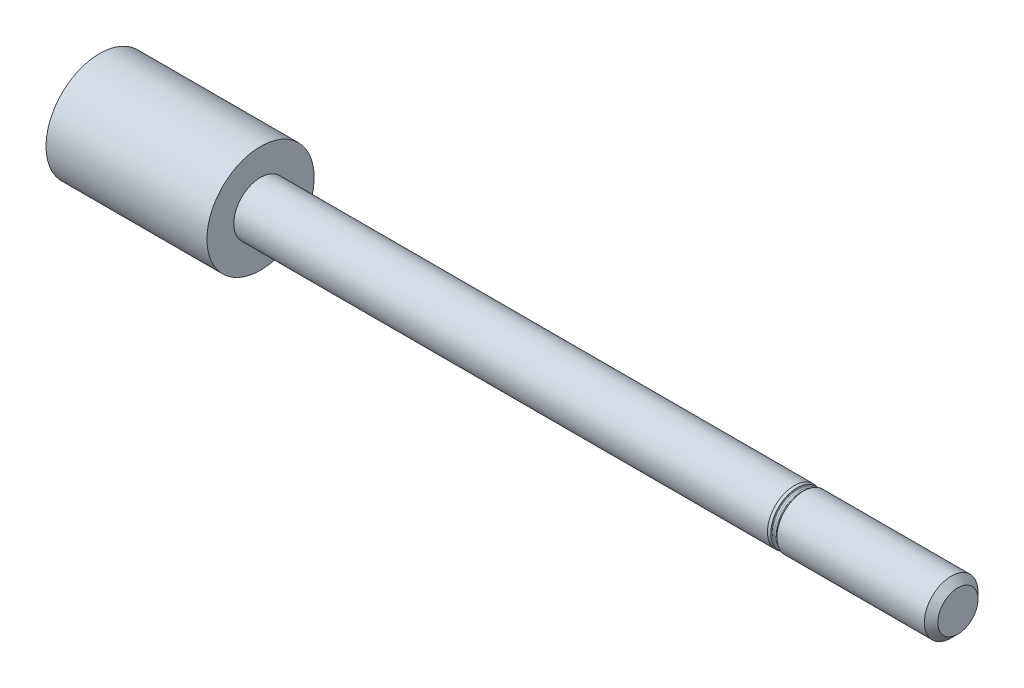
ISO-10303-21;
HEADER;
FILE_DESCRIPTION(('STEP AP214'),'2;1');
FILE_NAME('part.step','',(''),(''),'','','');
FILE_SCHEMA(('AUTOMOTIVE_DESIGN { 1 0 10303 214 1 1 1 1 }'));
ENDSEC;
DATA;
#1=APPLICATION_CONTEXT('core data for automotive mechanical design processes');
#2=APPLICATION_PROTOCOL_DEFINITION('international standard','automotive_design',2000,#1);
#3=PRODUCT_CONTEXT('',#1,'mechanical');
#4=PRODUCT('Part','Part','',(#3));
#5=PRODUCT_RELATED_PRODUCT_CATEGORY('part','',(#4));
#6=PRODUCT_DEFINITION_FORMATION('','',#4);
#7=PRODUCT_DEFINITION_CONTEXT('part definition',#1,'design');
#8=PRODUCT_DEFINITION('design','',#6,#7);
#9=PRODUCT_DEFINITION_SHAPE('','',#8);
#10=(LENGTH_UNIT() NAMED_UNIT(*) SI_UNIT(.MILLI.,.METRE.));
#11=(NAMED_UNIT(*) PLANE_ANGLE_UNIT() SI_UNIT($,.RADIAN.));
#12=(NAMED_UNIT(*) SI_UNIT($,.STERADIAN.) SOLID_ANGLE_UNIT());
#13=UNCERTAINTY_MEASURE_WITH_UNIT(LENGTH_MEASURE(1.E-05),#10,'distance_accuracy_value','');
#14=(GEOMETRIC_REPRESENTATION_CONTEXT(3) GLOBAL_UNCERTAINTY_ASSIGNED_CONTEXT((#13)) GLOBAL_UNIT_ASSIGNED_CONTEXT((#10,
#11,#12)) REPRESENTATION_CONTEXT('',''));
#15=CARTESIAN_POINT('',(0.,0.,0.));
#16=DIRECTION('',(0.,0.,1.));
#17=DIRECTION('',(1.,0.,0.));
#18=AXIS2_PLACEMENT_3D('',#15,#16,#17);
#19=CARTESIAN_POINT('',(27.,1.5,0.));
#20=DIRECTION('',(1.,0.,0.));
#21=DIRECTION('',(0.,0.,-1.));
#22=AXIS2_PLACEMENT_3D('',#19,#20,#21);
#23=PLANE('',#22);
#24=CARTESIAN_POINT('',(27.,0.,0.));
#25=DIRECTION('',(-1.,0.,0.));
#26=DIRECTION('',(0.,0.,1.));
#27=AXIS2_PLACEMENT_3D('',#24,#25,#26);
#28=CIRCLE('',#27,1.5);
#29=CARTESIAN_POINT('',(27.,0.,1.5));
#30=VERTEX_POINT('',#29);
#31=EDGE_CURVE('E10',#30,#30,#28,.T.);
#32=ORIENTED_EDGE('',*,*,#31,.F.);
#33=EDGE_LOOP('',(#32));
#34=FACE_BOUND('',#33,.T.);
#35=ADVANCED_FACE('F35',(#34),#23,.T.);
#36=CARTESIAN_POINT('',(26.5,0.,0.));
#37=DIRECTION('',(-1.,0.,0.));
#38=DIRECTION('',(0.,0.,1.));
#39=AXIS2_PLACEMENT_3D('',#36,#37,#38);
#40=CONICAL_SURFACE('',#39,2.,0.785398163397453);
#41=ORIENTED_EDGE('',*,*,#31,.T.);
#42=EDGE_LOOP('',(#41));
#43=FACE_BOUND('',#42,.T.);
#44=CARTESIAN_POINT('',(26.5,0.,0.));
#45=DIRECTION('',(-1.,0.,0.));
#46=DIRECTION('',(0.,0.,1.));
#47=AXIS2_PLACEMENT_3D('',#44,#45,#46);
#48=CIRCLE('',#47,2.);
#49=CARTESIAN_POINT('',(26.5,0.,2.));
#50=VERTEX_POINT('',#49);
#51=EDGE_CURVE('E41',#50,#50,#48,.T.);
#52=ORIENTED_EDGE('',*,*,#51,.F.);
#53=EDGE_LOOP('',(#52));
#54=FACE_BOUND('',#53,.T.);
#55=ADVANCED_FACE('F95',(#43,#54),#40,.T.);
#56=CARTESIAN_POINT('',(0.,0.,0.));
#57=DIRECTION('',(-1.,0.,0.));
#58=DIRECTION('',(0.,0.,1.));
#59=AXIS2_PLACEMENT_3D('',#56,#57,#58);
#60=CYLINDRICAL_SURFACE('',#59,2.);
#61=ORIENTED_EDGE('',*,*,#51,.T.);
#62=EDGE_LOOP('',(#61));
#63=FACE_BOUND('',#62,.T.);
#64=CARTESIAN_POINT('',(15.5,0.,0.));
#65=DIRECTION('',(-1.,0.,0.));
#66=DIRECTION('',(0.,0.,1.));
#67=AXIS2_PLACEMENT_3D('',#64,#65,#66);
#68=CIRCLE('',#67,2.);
#69=CARTESIAN_POINT('',(15.5,0.,2.));
#70=VERTEX_POINT('',#69);
#71=EDGE_CURVE('E45',#70,#70,#68,.T.);
#72=ORIENTED_EDGE('',*,*,#71,.F.);
#73=EDGE_LOOP('',(#72));
#74=FACE_BOUND('',#73,.T.);
#75=ADVANCED_FACE('F100',(#63,#74),#60,.T.);
#76=CARTESIAN_POINT('',(15.2792893218813,0.,0.));
#77=DIRECTION('',(1.,0.,0.));
#78=DIRECTION('',(0.,0.,-1.));
#79=AXIS2_PLACEMENT_3D('',#76,#77,#78);
#80=CONICAL_SURFACE('',#79,1.77928932188135,0.785398163397447);
#81=ORIENTED_EDGE('',*,*,#71,.T.);
#82=EDGE_LOOP('',(#81));
#83=FACE_BOUND('',#82,.T.);
#84=CARTESIAN_POINT('',(15.2792893218813,0.,0.));
#85=DIRECTION('',(-1.,0.,0.));
#86=DIRECTION('',(0.,0.,1.));
#87=AXIS2_PLACEMENT_3D('',#84,#85,#86);
#88=CIRCLE('',#87,1.77928932188135);
#89=CARTESIAN_POINT('',(15.2792893218813,0.,1.77928932188135));
#90=VERTEX_POINT('',#89);
#91=EDGE_CURVE('E49',#90,#90,#88,.T.);
#92=ORIENTED_EDGE('',*,*,#91,.F.);
#93=EDGE_LOOP('',(#92));
#94=FACE_BOUND('',#93,.T.);
#95=ADVANCED_FACE('F104',(#83,#94),#80,.T.);
#96=CARTESIAN_POINT('',(15.2085786437627,0.,0.));
#97=DIRECTION('',(-1.,0.,0.));
#98=DIRECTION('',(0.,0.,1.));
#99=AXIS2_PLACEMENT_3D('',#96,#97,#98);
#100=TOROIDAL_SURFACE('',#99,1.85,0.1);
#101=ORIENTED_EDGE('',*,*,#91,.T.);
#102=EDGE_LOOP('',(#101));
#103=FACE_BOUND('',#102,.T.);
#104=CARTESIAN_POINT('',(15.2085786437627,0.,0.));
#105=DIRECTION('',(-1.,0.,0.));
#106=DIRECTION('',(0.,0.,1.));
#107=AXIS2_PLACEMENT_3D('',#104,#105,#106);
#108=CIRCLE('',#107,1.75);
#109=CARTESIAN_POINT('',(15.2085786437627,0.,1.75));
#110=VERTEX_POINT('',#109);
#111=EDGE_CURVE('E54',#110,#110,#108,.T.);
#112=ORIENTED_EDGE('',*,*,#111,.F.);
#113=EDGE_LOOP('',(#112));
#114=FACE_BOUND('',#113,.T.);
#115=ADVANCED_FACE('F110',(#103,#114),#100,.F.);
#116=CARTESIAN_POINT('',(0.,0.,0.));
#117=DIRECTION('',(-1.,0.,0.));
#118=DIRECTION('',(0.,0.,1.));
#119=AXIS2_PLACEMENT_3D('',#116,#117,#118);
#120=CYLINDRICAL_SURFACE('',#119,1.75);
#121=ORIENTED_EDGE('',*,*,#111,.T.);
#122=EDGE_LOOP('',(#121));
#123=FACE_BOUND('',#122,.T.);
#124=CARTESIAN_POINT('',(15.1,0.,0.));
#125=DIRECTION('',(-1.,0.,0.));
#126=DIRECTION('',(0.,0.,1.));
#127=AXIS2_PLACEMENT_3D('',#124,#125,#126);
#128=CIRCLE('',#127,1.75);
#129=CARTESIAN_POINT('',(15.1,0.,1.75));
#130=VERTEX_POINT('',#129);
#131=EDGE_CURVE('E57',#130,#130,#128,.T.);
#132=ORIENTED_EDGE('',*,*,#131,.F.);
#133=EDGE_LOOP('',(#132));
#134=FACE_BOUND('',#133,.T.);
#135=ADVANCED_FACE('F114',(#123,#134),#120,.T.);
#136=CARTESIAN_POINT('',(15.1,0.,0.));
#137=DIRECTION('',(-1.,0.,0.));
#138=DIRECTION('',(0.,0.,1.));
#139=AXIS2_PLACEMENT_3D('',#136,#137,#138);
#140=TOROIDAL_SURFACE('',#139,1.85,0.1);
#141=ORIENTED_EDGE('',*,*,#131,.T.);
#142=EDGE_LOOP('',(#141));
#143=FACE_BOUND('',#142,.T.);
#144=CARTESIAN_POINT('',(15.,0.,0.));
#145=DIRECTION('',(-1.,0.,0.));
#146=DIRECTION('',(0.,0.,1.));
#147=AXIS2_PLACEMENT_3D('',#144,#145,#146);
#148=CIRCLE('',#147,1.85);
#149=CARTESIAN_POINT('',(15.,0.,1.85));
#150=VERTEX_POINT('',#149);
#151=EDGE_CURVE('E60',#150,#150,#148,.T.);
#152=ORIENTED_EDGE('',*,*,#151,.F.);
#153=EDGE_LOOP('',(#152));
#154=FACE_BOUND('',#153,.T.);
#155=ADVANCED_FACE('F118',(#143,#154),#140,.F.);
#156=CARTESIAN_POINT('',(15.,1.94641016151378,0.));
#157=DIRECTION('',(1.,0.,0.));
#158=DIRECTION('',(0.,0.,-1.));
#159=AXIS2_PLACEMENT_3D('',#156,#157,#158);
#160=PLANE('',#159);
#161=ORIENTED_EDGE('',*,*,#151,.T.);
#162=EDGE_LOOP('',(#161));
#163=FACE_BOUND('',#162,.T.);
#164=CARTESIAN_POINT('',(15.,0.,0.));
#165=DIRECTION('',(-1.,0.,0.));
#166=DIRECTION('',(0.,0.,1.));
#167=AXIS2_PLACEMENT_3D('',#164,#165,#166);
#168=CIRCLE('',#167,1.94641016151378);
#169=CARTESIAN_POINT('',(15.,0.,1.94641016151378));
#170=VERTEX_POINT('',#169);
#171=EDGE_CURVE('E63',#170,#170,#168,.T.);
#172=ORIENTED_EDGE('',*,*,#171,.F.);
#173=EDGE_LOOP('',(#172));
#174=FACE_BOUND('',#173,.T.);
#175=ADVANCED_FACE('F122',(#163,#174),#160,.T.);
#176=CARTESIAN_POINT('',(14.8,0.,0.));
#177=DIRECTION('',(-1.,0.,0.));
#178=DIRECTION('',(0.,0.,1.));
#179=AXIS2_PLACEMENT_3D('',#176,#177,#178);
#180=CONICAL_SURFACE('',#179,2.,0.26179938779915);
#181=ORIENTED_EDGE('',*,*,#171,.T.);
#182=EDGE_LOOP('',(#181));
#183=FACE_BOUND('',#182,.T.);
#184=CARTESIAN_POINT('',(14.8,0.,0.));
#185=DIRECTION('',(-1.,0.,0.));
#186=DIRECTION('',(0.,0.,1.));
#187=AXIS2_PLACEMENT_3D('',#184,#185,#186);
#188=CIRCLE('',#187,2.);
#189=CARTESIAN_POINT('',(14.8,0.,2.));
#190=VERTEX_POINT('',#189);
#191=EDGE_CURVE('E66',#190,#190,#188,.T.);
#192=ORIENTED_EDGE('',*,*,#191,.F.);
#193=EDGE_LOOP('',(#192));
#194=FACE_BOUND('',#193,.T.);
#195=ADVANCED_FACE('F126',(#183,#194),#180,.T.);
#196=CARTESIAN_POINT('',(0.,0.,0.));
#197=DIRECTION('',(-1.,0.,0.));
#198=DIRECTION('',(0.,0.,1.));
#199=AXIS2_PLACEMENT_3D('',#196,#197,#198);
#200=CYLINDRICAL_SURFACE('',#199,2.);
#201=ORIENTED_EDGE('',*,*,#191,.T.);
#202=EDGE_LOOP('',(#201));
#203=FACE_BOUND('',#202,.T.);
#204=CARTESIAN_POINT('',(-25.,0.,0.));
#205=DIRECTION('',(-1.,0.,0.));
#206=DIRECTION('',(0.,0.,1.));
#207=AXIS2_PLACEMENT_3D('',#204,#205,#206);
#208=CIRCLE('',#207,2.);
#209=CARTESIAN_POINT('',(-25.,0.,2.));
#210=VERTEX_POINT('',#209);
#211=EDGE_CURVE('E69',#210,#210,#208,.T.);
#212=ORIENTED_EDGE('',*,*,#211,.F.);
#213=EDGE_LOOP('',(#212));
#214=FACE_BOUND('',#213,.T.);
#215=ADVANCED_FACE('F91',(#203,#214),#200,.T.);
#216=CARTESIAN_POINT('',(-25.,2.,0.));
#217=DIRECTION('',(-1.,0.,0.));
#218=DIRECTION('',(0.,0.,1.));
#219=AXIS2_PLACEMENT_3D('',#216,#217,#218);
#220=PLANE('',#219);
#221=CARTESIAN_POINT('',(-25.,0.,0.));
#222=DIRECTION('',(-1.,0.,0.));
#223=DIRECTION('',(0.,0.,1.));
#224=AXIS2_PLACEMENT_3D('',#221,#222,#223);
#225=CIRCLE('',#224,4.);
#226=CARTESIAN_POINT('',(-25.,0.,4.));
#227=VERTEX_POINT('',#226);
#228=EDGE_CURVE('E72',#227,#227,#225,.T.);
#229=ORIENTED_EDGE('',*,*,#228,.F.);
#230=EDGE_LOOP('',(#229));
#231=FACE_BOUND('',#230,.T.);
#232=ORIENTED_EDGE('',*,*,#211,.T.);
#233=EDGE_LOOP('',(#232));
#234=FACE_BOUND('',#233,.T.);
#235=ADVANCED_FACE('F83',(#231,#234),#220,.F.);
#236=CARTESIAN_POINT('',(0.,0.,0.));
#237=DIRECTION('',(-1.,0.,0.));
#238=DIRECTION('',(0.,0.,1.));
#239=AXIS2_PLACEMENT_3D('',#236,#237,#238);
#240=CYLINDRICAL_SURFACE('',#239,4.);
#241=ORIENTED_EDGE('',*,*,#228,.T.);
#242=EDGE_LOOP('',(#241));
#243=FACE_BOUND('',#242,.T.);
#244=CARTESIAN_POINT('',(-37.,0.,0.));
#245=DIRECTION('',(-1.,0.,0.));
#246=DIRECTION('',(0.,0.,1.));
#247=AXIS2_PLACEMENT_3D('',#244,#245,#246);
#248=CIRCLE('',#247,4.);
#249=CARTESIAN_POINT('',(-37.,0.,4.));
#250=VERTEX_POINT('',#249);
#251=EDGE_CURVE('E75',#250,#250,#248,.T.);
#252=ORIENTED_EDGE('',*,*,#251,.F.);
#253=EDGE_LOOP('',(#252));
#254=FACE_BOUND('',#253,.T.);
#255=ADVANCED_FACE('F81',(#243,#254),#240,.T.);
#256=CARTESIAN_POINT('',(-37.,0.,0.));
#257=DIRECTION('',(-1.,0.,0.));
#258=DIRECTION('',(0.,0.,1.));
#259=AXIS2_PLACEMENT_3D('',#256,#257,#258);
#260=PLANE('',#259);
#261=ORIENTED_EDGE('',*,*,#251,.T.);
#262=EDGE_LOOP('',(#261));
#263=FACE_BOUND('',#262,.T.);
#264=ADVANCED_FACE('F79',(#263),#260,.T.);
#265=CLOSED_SHELL('',(#35,#55,#75,#95,#115,#135,#155,#175,#195,#215,#235,#255,#264));
#266=MANIFOLD_SOLID_BREP('B2',#265);
#267=ADVANCED_BREP_SHAPE_REPRESENTATION('',(#18,#266),#14);
#268=SHAPE_DEFINITION_REPRESENTATION(#9,#267);
ENDSEC;
END-ISO-10303-21;
